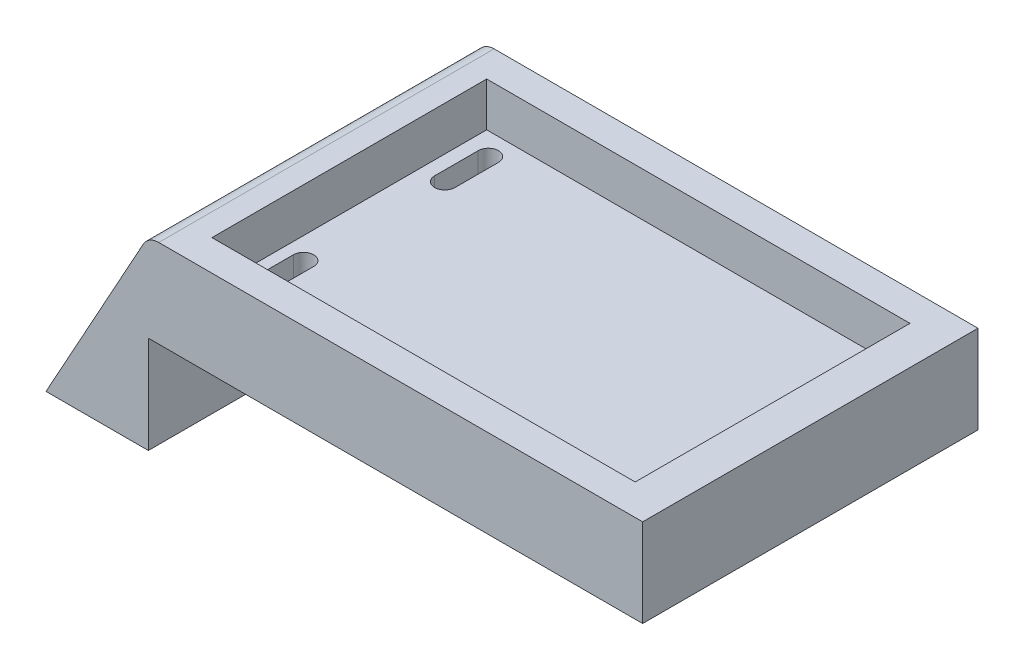
ISO-10303-21;
HEADER;
FILE_DESCRIPTION(('STEP AP214'),'2;1');
FILE_NAME('part.step','',(''),(''),'','','');
FILE_SCHEMA(('AUTOMOTIVE_DESIGN { 1 0 10303 214 1 1 1 1 }'));
ENDSEC;
DATA;
#1=APPLICATION_CONTEXT('core data for automotive mechanical design processes');
#2=APPLICATION_PROTOCOL_DEFINITION('international standard','automotive_design',2000,#1);
#3=PRODUCT_CONTEXT('',#1,'mechanical');
#4=PRODUCT('Part','Part','',(#3));
#5=PRODUCT_RELATED_PRODUCT_CATEGORY('part','',(#4));
#6=PRODUCT_DEFINITION_FORMATION('','',#4);
#7=PRODUCT_DEFINITION_CONTEXT('part definition',#1,'design');
#8=PRODUCT_DEFINITION('design','',#6,#7);
#9=PRODUCT_DEFINITION_SHAPE('','',#8);
#10=(LENGTH_UNIT() NAMED_UNIT(*) SI_UNIT(.MILLI.,.METRE.));
#11=(NAMED_UNIT(*) PLANE_ANGLE_UNIT() SI_UNIT($,.RADIAN.));
#12=(NAMED_UNIT(*) SI_UNIT($,.STERADIAN.) SOLID_ANGLE_UNIT());
#13=UNCERTAINTY_MEASURE_WITH_UNIT(LENGTH_MEASURE(1.E-05),#10,'distance_accuracy_value','');
#14=(GEOMETRIC_REPRESENTATION_CONTEXT(3) GLOBAL_UNCERTAINTY_ASSIGNED_CONTEXT((#13)) GLOBAL_UNIT_ASSIGNED_CONTEXT((#10,
#11,#12)) REPRESENTATION_CONTEXT('',''));
#15=CARTESIAN_POINT('',(0.,0.,0.));
#16=DIRECTION('',(0.,0.,1.));
#17=DIRECTION('',(1.,0.,0.));
#18=AXIS2_PLACEMENT_3D('',#15,#16,#17);
#19=CARTESIAN_POINT('',(-34.7548784400583,-12.7,-21.5329138161231));
#20=DIRECTION('',(0.,0.,-1.));
#21=DIRECTION('',(-1.,0.,0.));
#22=AXIS2_PLACEMENT_3D('',#19,#20,#21);
#23=PLANE('',#22);
#24=CARTESIAN_POINT('',(13.9227090818307,-12.7,-21.5329138161231));
#25=DIRECTION('',(0.,0.,-1.));
#26=DIRECTION('',(-1.,0.,0.));
#27=AXIS2_PLACEMENT_3D('',#24,#25,#26);
#28=CIRCLE('',#27,7.62);
#29=CARTESIAN_POINT('',(6.30270908183067,-12.7,-21.5329138161231));
#30=VERTEX_POINT('',#29);
#31=CARTESIAN_POINT('',(21.5427090818307,-12.7,-21.5329138161231));
#32=VERTEX_POINT('',#31);
#33=EDGE_CURVE('E261',#30,#32,#28,.T.);
#34=ORIENTED_EDGE('',*,*,#33,.F.);
#35=DIRECTION('',(-1.,0.,0.));
#36=VECTOR('',#35,1.);
#37=CARTESIAN_POINT('',(-34.7548784400583,-12.7,-21.5329138161231));
#38=LINE('',#37,#36);
#39=CARTESIAN_POINT('',(-34.7548784400583,-12.7,-21.5329138161231));
#40=VERTEX_POINT('',#39);
#41=EDGE_CURVE('E331',#30,#40,#38,.T.);
#42=ORIENTED_EDGE('',*,*,#41,.T.);
#43=DIRECTION('',(0.,1.,0.));
#44=VECTOR('',#43,1.);
#45=CARTESIAN_POINT('',(-34.7548784400583,-12.7,-21.5329138161231));
#46=LINE('',#45,#44);
#47=CARTESIAN_POINT('',(-34.7548784400583,-26.7296636371694,-21.5329138161231));
#48=VERTEX_POINT('',#47);
#49=EDGE_CURVE('E275',#48,#40,#46,.T.);
#50=ORIENTED_EDGE('',*,*,#49,.F.);
#51=DIRECTION('',(1.,0.,0.));
#52=VECTOR('',#51,1.);
#53=CARTESIAN_POINT('',(-34.7548784400583,-26.7296636371694,-21.5329138161231));
#54=LINE('',#53,#52);
#55=CARTESIAN_POINT('',(-49.5144814985387,-26.7296636371694,-21.5329138161231));
#56=VERTEX_POINT('',#55);
#57=EDGE_CURVE('E376',#56,#48,#54,.T.);
#58=ORIENTED_EDGE('',*,*,#57,.F.);
#59=DIRECTION('',(-0.483383688140556,-0.875408596050801,0.));
#60=VECTOR('',#59,1.);
#61=CARTESIAN_POINT('',(-49.5144814985387,-26.7296636371694,-21.5329138161231));
#62=LINE('',#61,#60);
#63=CARTESIAN_POINT('',(-35.4794528893374,-1.31220543212299,-21.5329138161231));
#64=VERTEX_POINT('',#63);
#65=EDGE_CURVE('E380',#64,#56,#62,.T.);
#66=ORIENTED_EDGE('',*,*,#65,.F.);
#67=CARTESIAN_POINT('',(-33.2559150553684,-2.54,-21.5329138161231));
#68=DIRECTION('',(0.,0.,-1.));
#69=DIRECTION('',(-1.,0.,0.));
#70=AXIS2_PLACEMENT_3D('',#67,#68,#69);
#71=CIRCLE('',#70,2.54);
#72=CARTESIAN_POINT('',(-33.2559150553684,0.,-21.5329138161231));
#73=VERTEX_POINT('',#72);
#74=EDGE_CURVE('E340',#64,#73,#71,.T.);
#75=ORIENTED_EDGE('',*,*,#74,.T.);
#76=DIRECTION('',(-1.,0.,0.));
#77=VECTOR('',#76,1.);
#78=CARTESIAN_POINT('',(-34.7548784400583,0.,-21.5329138161231));
#79=LINE('',#78,#77);
#80=CARTESIAN_POINT('',(36.5178070565831,0.,-21.5329138161231));
#81=VERTEX_POINT('',#80);
#82=EDGE_CURVE('E321',#81,#73,#79,.T.);
#83=ORIENTED_EDGE('',*,*,#82,.F.);
#84=DIRECTION('',(0.,1.,0.));
#85=VECTOR('',#84,1.);
#86=CARTESIAN_POINT('',(36.5178070565831,-12.7,-21.5329138161231));
#87=LINE('',#86,#85);
#88=CARTESIAN_POINT('',(36.5178070565831,-12.7,-21.5329138161231));
#89=VERTEX_POINT('',#88);
#90=EDGE_CURVE('E357',#89,#81,#87,.T.);
#91=ORIENTED_EDGE('',*,*,#90,.F.);
#92=EDGE_CURVE('E328',#89,#32,#38,.T.);
#93=ORIENTED_EDGE('',*,*,#92,.T.);
#94=EDGE_LOOP('',(#34,#42,#50,#58,#66,#75,#83,#91,#93));
#95=FACE_BOUND('',#94,.T.);
#96=ADVANCED_FACE('F32',(#95),#23,.T.);
#97=CARTESIAN_POINT('',(36.5178070565831,-12.7,-21.5329138161231));
#98=DIRECTION('',(1.,0.,0.));
#99=DIRECTION('',(0.,0.,-1.));
#100=AXIS2_PLACEMENT_3D('',#97,#98,#99);
#101=PLANE('',#100);
#102=DIRECTION('',(0.,0.,-1.));
#103=VECTOR('',#102,1.);
#104=CARTESIAN_POINT('',(36.5178070565831,0.,-21.5329138161231));
#105=LINE('',#104,#103);
#106=CARTESIAN_POINT('',(36.5178070565831,0.,26.8216996656972));
#107=VERTEX_POINT('',#106);
#108=EDGE_CURVE('E400',#107,#81,#105,.T.);
#109=ORIENTED_EDGE('',*,*,#108,.F.);
#110=DIRECTION('',(0.,1.,0.));
#111=VECTOR('',#110,1.);
#112=CARTESIAN_POINT('',(36.5178070565831,-12.7,26.8216996656972));
#113=LINE('',#112,#111);
#114=CARTESIAN_POINT('',(36.5178070565831,-12.7,26.8216996656972));
#115=VERTEX_POINT('',#114);
#116=EDGE_CURVE('E322',#115,#107,#113,.T.);
#117=ORIENTED_EDGE('',*,*,#116,.F.);
#118=DIRECTION('',(0.,0.,-1.));
#119=VECTOR('',#118,1.);
#120=CARTESIAN_POINT('',(36.5178070565831,-12.7,-21.5329138161231));
#121=LINE('',#120,#119);
#122=EDGE_CURVE('E313',#115,#89,#121,.T.);
#123=ORIENTED_EDGE('',*,*,#122,.T.);
#124=ORIENTED_EDGE('',*,*,#90,.T.);
#125=EDGE_LOOP('',(#109,#117,#123,#124));
#126=FACE_BOUND('',#125,.T.);
#127=ADVANCED_FACE('F413',(#126),#101,.T.);
#128=CARTESIAN_POINT('',(-34.7548784400583,-12.7,26.8216996656972));
#129=DIRECTION('',(0.,0.,1.));
#130=DIRECTION('',(1.,0.,0.));
#131=AXIS2_PLACEMENT_3D('',#128,#129,#130);
#132=PLANE('',#131);
#133=DIRECTION('',(1.,0.,0.));
#134=VECTOR('',#133,1.);
#135=CARTESIAN_POINT('',(-34.7548784400583,0.,26.8216996656972));
#136=LINE('',#135,#134);
#137=CARTESIAN_POINT('',(-33.2559150553684,0.,26.8216996656972));
#138=VERTEX_POINT('',#137);
#139=EDGE_CURVE('E304',#138,#107,#136,.T.);
#140=ORIENTED_EDGE('',*,*,#139,.F.);
#141=CARTESIAN_POINT('',(-33.2559150553684,-2.54,26.8216996656972));
#142=DIRECTION('',(0.,0.,1.));
#143=DIRECTION('',(1.,0.,0.));
#144=AXIS2_PLACEMENT_3D('',#141,#142,#143);
#145=CIRCLE('',#144,2.54);
#146=CARTESIAN_POINT('',(-35.4794528893374,-1.31220543212299,26.8216996656972));
#147=VERTEX_POINT('',#146);
#148=EDGE_CURVE('E387',#138,#147,#145,.T.);
#149=ORIENTED_EDGE('',*,*,#148,.T.);
#150=DIRECTION('',(-0.483383688140556,-0.875408596050801,0.));
#151=VECTOR('',#150,1.);
#152=CARTESIAN_POINT('',(-49.5144814985387,-26.7296636371694,26.8216996656972));
#153=LINE('',#152,#151);
#154=CARTESIAN_POINT('',(-49.5144814985387,-26.7296636371694,26.8216996656972));
#155=VERTEX_POINT('',#154);
#156=EDGE_CURVE('E274',#147,#155,#153,.T.);
#157=ORIENTED_EDGE('',*,*,#156,.T.);
#158=DIRECTION('',(1.,0.,0.));
#159=VECTOR('',#158,1.);
#160=CARTESIAN_POINT('',(-34.7548784400583,-26.7296636371694,26.8216996656972));
#161=LINE('',#160,#159);
#162=CARTESIAN_POINT('',(-34.7548784400583,-26.7296636371694,26.8216996656972));
#163=VERTEX_POINT('',#162);
#164=EDGE_CURVE('E268',#155,#163,#161,.T.);
#165=ORIENTED_EDGE('',*,*,#164,.T.);
#166=DIRECTION('',(0.,1.,0.));
#167=VECTOR('',#166,1.);
#168=CARTESIAN_POINT('',(-34.7548784400583,-12.7,26.8216996656972));
#169=LINE('',#168,#167);
#170=CARTESIAN_POINT('',(-34.7548784400583,-12.7,26.8216996656972));
#171=VERTEX_POINT('',#170);
#172=EDGE_CURVE('E264',#163,#171,#169,.T.);
#173=ORIENTED_EDGE('',*,*,#172,.T.);
#174=DIRECTION('',(1.,0.,0.));
#175=VECTOR('',#174,1.);
#176=CARTESIAN_POINT('',(-34.7548784400583,-12.7,26.8216996656972));
#177=LINE('',#176,#175);
#178=EDGE_CURVE('E320',#171,#115,#177,.T.);
#179=ORIENTED_EDGE('',*,*,#178,.T.);
#180=ORIENTED_EDGE('',*,*,#116,.T.);
#181=EDGE_LOOP('',(#140,#149,#157,#165,#173,#179,#180));
#182=FACE_BOUND('',#181,.T.);
#183=ADVANCED_FACE('F364',(#182),#132,.T.);
#184=CARTESIAN_POINT('',(0.,-12.7,0.));
#185=DIRECTION('',(0.,1.,0.));
#186=DIRECTION('',(0.,0.,1.));
#187=AXIS2_PLACEMENT_3D('',#184,#185,#186);
#188=PLANE('',#187);
#189=DIRECTION('',(0.,0.,1.));
#190=VECTOR('',#189,1.);
#191=CARTESIAN_POINT('',(-25.4358431669078,-12.7,12.2982140969415));
#192=LINE('',#191,#190);
#193=CARTESIAN_POINT('',(-25.4358431669078,-12.7,12.2982140969415));
#194=VERTEX_POINT('',#193);
#195=CARTESIAN_POINT('',(-25.4358431669078,-12.7,18.5882371670049));
#196=VERTEX_POINT('',#195);
#197=EDGE_CURVE('E209',#194,#196,#192,.T.);
#198=ORIENTED_EDGE('',*,*,#197,.F.);
#199=CARTESIAN_POINT('',(-26.9006430599363,-12.7,12.2982140969415));
#200=DIRECTION('',(0.,1.,0.));
#201=DIRECTION('',(0.,0.,1.));
#202=AXIS2_PLACEMENT_3D('',#199,#200,#201);
#203=CIRCLE('',#202,1.46479989302845);
#204=CARTESIAN_POINT('',(-28.3654429529647,-12.7,12.2982140969415));
#205=VERTEX_POINT('',#204);
#206=EDGE_CURVE('E212',#205,#194,#203,.F.);
#207=ORIENTED_EDGE('',*,*,#206,.F.);
#208=DIRECTION('',(0.,0.,-1.));
#209=VECTOR('',#208,1.);
#210=CARTESIAN_POINT('',(-28.3654429529647,-12.7,12.2982140969415));
#211=LINE('',#210,#209);
#212=CARTESIAN_POINT('',(-28.3654429529647,-12.7,18.5882371670049));
#213=VERTEX_POINT('',#212);
#214=EDGE_CURVE('E214',#213,#205,#211,.T.);
#215=ORIENTED_EDGE('',*,*,#214,.F.);
#216=CARTESIAN_POINT('',(-26.9006430599363,-12.7,18.5882371670049));
#217=DIRECTION('',(0.,1.,0.));
#218=DIRECTION('',(0.,0.,1.));
#219=AXIS2_PLACEMENT_3D('',#216,#217,#218);
#220=CIRCLE('',#219,1.46479989302845);
#221=EDGE_CURVE('E207',#196,#213,#220,.F.);
#222=ORIENTED_EDGE('',*,*,#221,.F.);
#223=EDGE_LOOP('',(#198,#207,#215,#222));
#224=FACE_BOUND('',#223,.T.);
#225=DIRECTION('',(0.,0.,1.));
#226=VECTOR('',#225,1.);
#227=CARTESIAN_POINT('',(-25.1098998323982,-12.7,-14.0284764458604));
#228=LINE('',#227,#226);
#229=CARTESIAN_POINT('',(-25.1098998323982,-12.7,-14.0284764458604));
#230=VERTEX_POINT('',#229);
#231=CARTESIAN_POINT('',(-25.1098998323982,-12.7,-7.73845337579703));
#232=VERTEX_POINT('',#231);
#233=EDGE_CURVE('E236',#230,#232,#228,.T.);
#234=ORIENTED_EDGE('',*,*,#233,.F.);
#235=CARTESIAN_POINT('',(-26.5746997254267,-12.7,-14.0284764458604));
#236=DIRECTION('',(0.,1.,0.));
#237=DIRECTION('',(0.,0.,1.));
#238=AXIS2_PLACEMENT_3D('',#235,#236,#237);
#239=CIRCLE('',#238,1.46479989302845);
#240=CARTESIAN_POINT('',(-28.0394996184551,-12.7,-14.0284764458604));
#241=VERTEX_POINT('',#240);
#242=EDGE_CURVE('E239',#241,#230,#239,.F.);
#243=ORIENTED_EDGE('',*,*,#242,.F.);
#244=DIRECTION('',(0.,0.,-1.));
#245=VECTOR('',#244,1.);
#246=CARTESIAN_POINT('',(-28.0394996184551,-12.7,-14.0284764458604));
#247=LINE('',#246,#245);
#248=CARTESIAN_POINT('',(-28.0394996184551,-12.7,-7.73845337579703));
#249=VERTEX_POINT('',#248);
#250=EDGE_CURVE('E241',#249,#241,#247,.T.);
#251=ORIENTED_EDGE('',*,*,#250,.F.);
#252=CARTESIAN_POINT('',(-26.5746997254267,-12.7,-7.73845337579703));
#253=DIRECTION('',(0.,1.,0.));
#254=DIRECTION('',(0.,0.,1.));
#255=AXIS2_PLACEMENT_3D('',#252,#253,#254);
#256=CIRCLE('',#255,1.46479989302845);
#257=EDGE_CURVE('E233',#232,#249,#256,.F.);
#258=ORIENTED_EDGE('',*,*,#257,.F.);
#259=EDGE_LOOP('',(#234,#243,#251,#258));
#260=FACE_BOUND('',#259,.T.);
#261=DIRECTION('',(-1.,0.,0.));
#262=VECTOR('',#261,1.);
#263=CARTESIAN_POINT('',(0.,-12.7,-18.9929138161231));
#264=LINE('',#263,#262);
#265=CARTESIAN_POINT('',(21.5427090818307,-12.7,-18.9929138161231));
#266=VERTEX_POINT('',#265);
#267=CARTESIAN_POINT('',(6.30270908183067,-12.7,-18.9929138161231));
#268=VERTEX_POINT('',#267);
#269=EDGE_CURVE('E342',#266,#268,#264,.T.);
#270=ORIENTED_EDGE('',*,*,#269,.F.);
#271=DIRECTION('',(0.,0.,-1.));
#272=VECTOR('',#271,1.);
#273=CARTESIAN_POINT('',(21.5427090818307,-12.7,-18.9929138161231));
#274=LINE('',#273,#272);
#275=EDGE_CURVE('E11',#266,#32,#274,.T.);
#276=ORIENTED_EDGE('',*,*,#275,.T.);
#277=ORIENTED_EDGE('',*,*,#92,.F.);
#278=ORIENTED_EDGE('',*,*,#122,.F.);
#279=ORIENTED_EDGE('',*,*,#178,.F.);
#280=DIRECTION('',(0.,0.,1.));
#281=VECTOR('',#280,1.);
#282=CARTESIAN_POINT('',(-34.7548784400583,-12.7,-21.5329138161231));
#283=LINE('',#282,#281);
#284=EDGE_CURVE('E316',#40,#171,#283,.T.);
#285=ORIENTED_EDGE('',*,*,#284,.F.);
#286=ORIENTED_EDGE('',*,*,#41,.F.);
#287=DIRECTION('',(0.,0.,-1.));
#288=VECTOR('',#287,1.);
#289=CARTESIAN_POINT('',(6.30270908183067,-12.7,-18.9929138161231));
#290=LINE('',#289,#288);
#291=EDGE_CURVE('E40',#30,#268,#290,.F.);
#292=ORIENTED_EDGE('',*,*,#291,.T.);
#293=EDGE_LOOP('',(#270,#276,#277,#278,#279,#285,#286,#292));
#294=FACE_BOUND('',#293,.T.);
#295=ADVANCED_FACE('F347',(#224,#260,#294),#188,.F.);
#296=CARTESIAN_POINT('',(0.,0.,0.));
#297=DIRECTION('',(0.,1.,0.));
#298=DIRECTION('',(0.,0.,1.));
#299=AXIS2_PLACEMENT_3D('',#296,#297,#298);
#300=PLANE('',#299);
#301=DIRECTION('',(0.,0.,1.));
#302=VECTOR('',#301,1.);
#303=CARTESIAN_POINT('',(-30.0270973551157,0.,-17.2355941958845));
#304=LINE('',#303,#302);
#305=CARTESIAN_POINT('',(-30.0270973551157,0.,-17.2355941958845));
#306=VERTEX_POINT('',#305);
#307=CARTESIAN_POINT('',(-30.0270973551157,0.,22.3816153264591));
#308=VERTEX_POINT('',#307);
#309=EDGE_CURVE('E292',#306,#308,#304,.T.);
#310=ORIENTED_EDGE('',*,*,#309,.F.);
#311=DIRECTION('',(-1.,0.,0.));
#312=VECTOR('',#311,1.);
#313=CARTESIAN_POINT('',(-30.0270973551157,0.,-17.2355941958845));
#314=LINE('',#313,#312);
#315=CARTESIAN_POINT('',(31.0048200171435,0.,-17.2355941958845));
#316=VERTEX_POINT('',#315);
#317=EDGE_CURVE('E282',#316,#306,#314,.T.);
#318=ORIENTED_EDGE('',*,*,#317,.F.);
#319=DIRECTION('',(0.,0.,-1.));
#320=VECTOR('',#319,1.);
#321=CARTESIAN_POINT('',(31.0048200171435,0.,-17.2355941958845));
#322=LINE('',#321,#320);
#323=CARTESIAN_POINT('',(31.0048200171435,0.,22.3816153264591));
#324=VERTEX_POINT('',#323);
#325=EDGE_CURVE('E297',#324,#316,#322,.T.);
#326=ORIENTED_EDGE('',*,*,#325,.F.);
#327=DIRECTION('',(1.,0.,0.));
#328=VECTOR('',#327,1.);
#329=CARTESIAN_POINT('',(-30.0270973551157,0.,22.3816153264591));
#330=LINE('',#329,#328);
#331=EDGE_CURVE('E294',#308,#324,#330,.T.);
#332=ORIENTED_EDGE('',*,*,#331,.F.);
#333=EDGE_LOOP('',(#310,#318,#326,#332));
#334=FACE_BOUND('',#333,.T.);
#335=ORIENTED_EDGE('',*,*,#82,.T.);
#336=DIRECTION('',(0.,0.,1.));
#337=VECTOR('',#336,1.);
#338=CARTESIAN_POINT('',(-33.2559150553684,0.,0.));
#339=LINE('',#338,#337);
#340=EDGE_CURVE('E334',#73,#138,#339,.T.);
#341=ORIENTED_EDGE('',*,*,#340,.T.);
#342=ORIENTED_EDGE('',*,*,#139,.T.);
#343=ORIENTED_EDGE('',*,*,#108,.T.);
#344=EDGE_LOOP('',(#335,#341,#342,#343));
#345=FACE_BOUND('',#344,.T.);
#346=ADVANCED_FACE('F401',(#334,#345),#300,.T.);
#347=CARTESIAN_POINT('',(-30.0270973551157,-6.35,-17.2355941958845));
#348=DIRECTION('',(-1.,0.,0.));
#349=DIRECTION('',(0.,0.,1.));
#350=AXIS2_PLACEMENT_3D('',#347,#348,#349);
#351=PLANE('',#350);
#352=ORIENTED_EDGE('',*,*,#309,.T.);
#353=DIRECTION('',(0.,1.,0.));
#354=VECTOR('',#353,1.);
#355=CARTESIAN_POINT('',(-30.0270973551157,-6.35,22.3816153264591));
#356=LINE('',#355,#354);
#357=CARTESIAN_POINT('',(-30.0270973551157,-6.35,22.3816153264591));
#358=VERTEX_POINT('',#357);
#359=EDGE_CURVE('E291',#358,#308,#356,.T.);
#360=ORIENTED_EDGE('',*,*,#359,.F.);
#361=DIRECTION('',(0.,0.,1.));
#362=VECTOR('',#361,1.);
#363=CARTESIAN_POINT('',(-30.0270973551157,-6.35,-17.2355941958845));
#364=LINE('',#363,#362);
#365=CARTESIAN_POINT('',(-30.0270973551157,-6.35,-17.2355941958845));
#366=VERTEX_POINT('',#365);
#367=EDGE_CURVE('E278',#366,#358,#364,.T.);
#368=ORIENTED_EDGE('',*,*,#367,.F.);
#369=DIRECTION('',(0.,1.,0.));
#370=VECTOR('',#369,1.);
#371=CARTESIAN_POINT('',(-30.0270973551157,-6.35,-17.2355941958845));
#372=LINE('',#371,#370);
#373=EDGE_CURVE('E302',#366,#306,#372,.T.);
#374=ORIENTED_EDGE('',*,*,#373,.T.);
#375=EDGE_LOOP('',(#352,#360,#368,#374));
#376=FACE_BOUND('',#375,.T.);
#377=ADVANCED_FACE('F429',(#376),#351,.F.);
#378=CARTESIAN_POINT('',(-30.0270973551157,-6.35,-17.2355941958845));
#379=DIRECTION('',(0.,0.,-1.));
#380=DIRECTION('',(-1.,0.,0.));
#381=AXIS2_PLACEMENT_3D('',#378,#379,#380);
#382=PLANE('',#381);
#383=ORIENTED_EDGE('',*,*,#317,.T.);
#384=ORIENTED_EDGE('',*,*,#373,.F.);
#385=DIRECTION('',(-1.,0.,0.));
#386=VECTOR('',#385,1.);
#387=CARTESIAN_POINT('',(-30.0270973551157,-6.35,-17.2355941958845));
#388=LINE('',#387,#386);
#389=CARTESIAN_POINT('',(31.0048200171435,-6.35,-17.2355941958845));
#390=VERTEX_POINT('',#389);
#391=EDGE_CURVE('E288',#390,#366,#388,.T.);
#392=ORIENTED_EDGE('',*,*,#391,.F.);
#393=DIRECTION('',(0.,1.,0.));
#394=VECTOR('',#393,1.);
#395=CARTESIAN_POINT('',(31.0048200171435,-6.35,-17.2355941958845));
#396=LINE('',#395,#394);
#397=EDGE_CURVE('E305',#390,#316,#396,.T.);
#398=ORIENTED_EDGE('',*,*,#397,.T.);
#399=EDGE_LOOP('',(#383,#384,#392,#398));
#400=FACE_BOUND('',#399,.T.);
#401=ADVANCED_FACE('F436',(#400),#382,.F.);
#402=CARTESIAN_POINT('',(31.0048200171435,-6.35,-17.2355941958845));
#403=DIRECTION('',(1.,0.,0.));
#404=DIRECTION('',(0.,0.,-1.));
#405=AXIS2_PLACEMENT_3D('',#402,#403,#404);
#406=PLANE('',#405);
#407=ORIENTED_EDGE('',*,*,#325,.T.);
#408=ORIENTED_EDGE('',*,*,#397,.F.);
#409=DIRECTION('',(0.,0.,-1.));
#410=VECTOR('',#409,1.);
#411=CARTESIAN_POINT('',(31.0048200171435,-6.35,-17.2355941958845));
#412=LINE('',#411,#410);
#413=CARTESIAN_POINT('',(31.0048200171435,-6.35,22.3816153264591));
#414=VERTEX_POINT('',#413);
#415=EDGE_CURVE('E285',#414,#390,#412,.T.);
#416=ORIENTED_EDGE('',*,*,#415,.F.);
#417=DIRECTION('',(0.,1.,0.));
#418=VECTOR('',#417,1.);
#419=CARTESIAN_POINT('',(31.0048200171435,-6.35,22.3816153264591));
#420=LINE('',#419,#418);
#421=EDGE_CURVE('E307',#414,#324,#420,.T.);
#422=ORIENTED_EDGE('',*,*,#421,.T.);
#423=EDGE_LOOP('',(#407,#408,#416,#422));
#424=FACE_BOUND('',#423,.T.);
#425=ADVANCED_FACE('F441',(#424),#406,.F.);
#426=CARTESIAN_POINT('',(-30.0270973551157,-6.35,22.3816153264591));
#427=DIRECTION('',(0.,0.,1.));
#428=DIRECTION('',(1.,0.,0.));
#429=AXIS2_PLACEMENT_3D('',#426,#427,#428);
#430=PLANE('',#429);
#431=ORIENTED_EDGE('',*,*,#331,.T.);
#432=ORIENTED_EDGE('',*,*,#421,.F.);
#433=DIRECTION('',(1.,0.,0.));
#434=VECTOR('',#433,1.);
#435=CARTESIAN_POINT('',(-30.0270973551157,-6.35,22.3816153264591));
#436=LINE('',#435,#434);
#437=EDGE_CURVE('E281',#358,#414,#436,.T.);
#438=ORIENTED_EDGE('',*,*,#437,.F.);
#439=ORIENTED_EDGE('',*,*,#359,.T.);
#440=EDGE_LOOP('',(#431,#432,#438,#439));
#441=FACE_BOUND('',#440,.T.);
#442=ADVANCED_FACE('F438',(#441),#430,.F.);
#443=CARTESIAN_POINT('',(0.,-6.35,0.));
#444=DIRECTION('',(0.,1.,0.));
#445=DIRECTION('',(0.,0.,1.));
#446=AXIS2_PLACEMENT_3D('',#443,#444,#445);
#447=PLANE('',#446);
#448=CARTESIAN_POINT('',(-26.9006430599363,-6.35,12.2982140969415));
#449=DIRECTION('',(0.,1.,0.));
#450=DIRECTION('',(0.,0.,1.));
#451=AXIS2_PLACEMENT_3D('',#448,#449,#450);
#452=CIRCLE('',#451,1.46479989302845);
#453=CARTESIAN_POINT('',(-25.4358431669078,-6.35,12.2982140969415));
#454=VERTEX_POINT('',#453);
#455=CARTESIAN_POINT('',(-28.3654429529647,-6.35,12.2982140969415));
#456=VERTEX_POINT('',#455);
#457=EDGE_CURVE('E192',#454,#456,#452,.T.);
#458=ORIENTED_EDGE('',*,*,#457,.F.);
#459=DIRECTION('',(0.,0.,-1.));
#460=VECTOR('',#459,1.);
#461=CARTESIAN_POINT('',(-25.4358431669078,-6.35,12.2982140969415));
#462=LINE('',#461,#460);
#463=CARTESIAN_POINT('',(-25.4358431669078,-6.35,18.5882371670049));
#464=VERTEX_POINT('',#463);
#465=EDGE_CURVE('E221',#464,#454,#462,.T.);
#466=ORIENTED_EDGE('',*,*,#465,.F.);
#467=CARTESIAN_POINT('',(-26.9006430599363,-6.35,18.5882371670049));
#468=DIRECTION('',(0.,1.,0.));
#469=DIRECTION('',(0.,0.,1.));
#470=AXIS2_PLACEMENT_3D('',#467,#468,#469);
#471=CIRCLE('',#470,1.46479989302845);
#472=CARTESIAN_POINT('',(-28.3654429529647,-6.35,18.5882371670049));
#473=VERTEX_POINT('',#472);
#474=EDGE_CURVE('E218',#473,#464,#471,.T.);
#475=ORIENTED_EDGE('',*,*,#474,.F.);
#476=DIRECTION('',(0.,0.,1.));
#477=VECTOR('',#476,1.);
#478=CARTESIAN_POINT('',(-28.3654429529647,-6.35,12.2982140969415));
#479=LINE('',#478,#477);
#480=EDGE_CURVE('E216',#456,#473,#479,.T.);
#481=ORIENTED_EDGE('',*,*,#480,.F.);
#482=EDGE_LOOP('',(#458,#466,#475,#481));
#483=FACE_BOUND('',#482,.T.);
#484=CARTESIAN_POINT('',(-26.5746997254267,-6.35,-14.0284764458604));
#485=DIRECTION('',(0.,1.,0.));
#486=DIRECTION('',(0.,0.,1.));
#487=AXIS2_PLACEMENT_3D('',#484,#485,#486);
#488=CIRCLE('',#487,1.46479989302845);
#489=CARTESIAN_POINT('',(-25.1098998323982,-6.35,-14.0284764458604));
#490=VERTEX_POINT('',#489);
#491=CARTESIAN_POINT('',(-28.0394996184551,-6.35,-14.0284764458604));
#492=VERTEX_POINT('',#491);
#493=EDGE_CURVE('E232',#490,#492,#488,.T.);
#494=ORIENTED_EDGE('',*,*,#493,.F.);
#495=DIRECTION('',(0.,0.,-1.));
#496=VECTOR('',#495,1.);
#497=CARTESIAN_POINT('',(-25.1098998323982,-6.35,-14.0284764458604));
#498=LINE('',#497,#496);
#499=CARTESIAN_POINT('',(-25.1098998323982,-6.35,-7.73845337579703));
#500=VERTEX_POINT('',#499);
#501=EDGE_CURVE('E249',#500,#490,#498,.T.);
#502=ORIENTED_EDGE('',*,*,#501,.F.);
#503=CARTESIAN_POINT('',(-26.5746997254267,-6.35,-7.73845337579703));
#504=DIRECTION('',(0.,1.,0.));
#505=DIRECTION('',(0.,0.,1.));
#506=AXIS2_PLACEMENT_3D('',#503,#504,#505);
#507=CIRCLE('',#506,1.46479989302845);
#508=CARTESIAN_POINT('',(-28.0394996184551,-6.35,-7.73845337579703));
#509=VERTEX_POINT('',#508);
#510=EDGE_CURVE('E246',#509,#500,#507,.T.);
#511=ORIENTED_EDGE('',*,*,#510,.F.);
#512=DIRECTION('',(0.,0.,1.));
#513=VECTOR('',#512,1.);
#514=CARTESIAN_POINT('',(-28.0394996184551,-6.35,-14.0284764458604));
#515=LINE('',#514,#513);
#516=EDGE_CURVE('E243',#492,#509,#515,.T.);
#517=ORIENTED_EDGE('',*,*,#516,.F.);
#518=EDGE_LOOP('',(#494,#502,#511,#517));
#519=FACE_BOUND('',#518,.T.);
#520=ORIENTED_EDGE('',*,*,#367,.T.);
#521=ORIENTED_EDGE('',*,*,#437,.T.);
#522=ORIENTED_EDGE('',*,*,#415,.T.);
#523=ORIENTED_EDGE('',*,*,#391,.T.);
#524=EDGE_LOOP('',(#520,#521,#522,#523));
#525=FACE_BOUND('',#524,.T.);
#526=ADVANCED_FACE('F410',(#483,#519,#525),#447,.T.);
#527=CARTESIAN_POINT('',(-49.5144814985387,-26.7296636371694,-52.0668424955466));
#528=DIRECTION('',(-0.875408596050801,0.483383688140556,0.));
#529=DIRECTION('',(-0.483383688140556,-0.875408596050801,0.));
#530=AXIS2_PLACEMENT_3D('',#527,#528,#529);
#531=PLANE('',#530);
#532=ORIENTED_EDGE('',*,*,#156,.F.);
#533=DIRECTION('',(0.,0.,1.));
#534=VECTOR('',#533,1.);
#535=CARTESIAN_POINT('',(-35.4794528893374,-1.31220543212299,-52.0668424955466));
#536=LINE('',#535,#534);
#537=EDGE_CURVE('E390',#147,#64,#536,.F.);
#538=ORIENTED_EDGE('',*,*,#537,.T.);
#539=ORIENTED_EDGE('',*,*,#65,.T.);
#540=DIRECTION('',(0.,0.,1.));
#541=VECTOR('',#540,1.);
#542=CARTESIAN_POINT('',(-49.5144814985387,-26.7296636371694,-52.0668424955466));
#543=LINE('',#542,#541);
#544=EDGE_CURVE('E378',#56,#155,#543,.T.);
#545=ORIENTED_EDGE('',*,*,#544,.T.);
#546=EDGE_LOOP('',(#532,#538,#539,#545));
#547=FACE_BOUND('',#546,.T.);
#548=ADVANCED_FACE('F389',(#547),#531,.T.);
#549=CARTESIAN_POINT('',(-34.7548784400583,-26.7296636371694,-52.0668424955466));
#550=DIRECTION('',(0.,-1.,0.));
#551=DIRECTION('',(0.,0.,-1.));
#552=AXIS2_PLACEMENT_3D('',#549,#550,#551);
#553=PLANE('',#552);
#554=CARTESIAN_POINT('',(-34.7548784400583,-26.7296636371694,2.64439292478705));
#555=DIRECTION('',(0.,-1.,0.));
#556=DIRECTION('',(0.,0.,-1.));
#557=AXIS2_PLACEMENT_3D('',#554,#555,#556);
#558=CIRCLE('',#557,6.1837307243377);
#559=CARTESIAN_POINT('',(-34.7548784400583,-26.7296636371694,8.82812364912475));
#560=VERTEX_POINT('',#559);
#561=CARTESIAN_POINT('',(-34.7548784400583,-26.7296636371694,-3.53933779955064));
#562=VERTEX_POINT('',#561);
#563=EDGE_CURVE('E47',#560,#562,#558,.T.);
#564=ORIENTED_EDGE('',*,*,#563,.F.);
#565=DIRECTION('',(0.,0.,1.));
#566=VECTOR('',#565,1.);
#567=CARTESIAN_POINT('',(-34.7548784400583,-26.7296636371694,-52.0668424955466));
#568=LINE('',#567,#566);
#569=EDGE_CURVE('E369',#560,#163,#568,.T.);
#570=ORIENTED_EDGE('',*,*,#569,.T.);
#571=ORIENTED_EDGE('',*,*,#164,.F.);
#572=ORIENTED_EDGE('',*,*,#544,.F.);
#573=ORIENTED_EDGE('',*,*,#57,.T.);
#574=EDGE_CURVE('E371',#48,#562,#568,.T.);
#575=ORIENTED_EDGE('',*,*,#574,.T.);
#576=EDGE_LOOP('',(#564,#570,#571,#572,#573,#575));
#577=FACE_BOUND('',#576,.T.);
#578=ADVANCED_FACE('F402',(#577),#553,.T.);
#579=CARTESIAN_POINT('',(-34.7548784400583,-12.7,-52.0668424955466));
#580=DIRECTION('',(1.,0.,0.));
#581=DIRECTION('',(0.,0.,-1.));
#582=AXIS2_PLACEMENT_3D('',#579,#580,#581);
#583=PLANE('',#582);
#584=DIRECTION('',(0.,0.959315799354055,-0.282335256582828));
#585=VECTOR('',#584,1.);
#586=CARTESIAN_POINT('',(-34.7548784400583,-13.5483287562623,4.94873839537312));
#587=LINE('',#586,#585);
#588=CARTESIAN_POINT('',(-34.7548784400583,-13.5483287562623,4.94873839537312));
#589=VERTEX_POINT('',#588);
#590=EDGE_CURVE('E199',#560,#589,#587,.T.);
#591=ORIENTED_EDGE('',*,*,#590,.T.);
#592=DIRECTION('',(0.,0.,-1.));
#593=VECTOR('',#592,1.);
#594=CARTESIAN_POINT('',(-34.7548784400583,-13.5483287562623,2.64439292478705));
#595=LINE('',#594,#593);
#596=CARTESIAN_POINT('',(-34.7548784400583,-13.5483287562623,0.340047454200985));
#597=VERTEX_POINT('',#596);
#598=EDGE_CURVE('E190',#589,#597,#595,.T.);
#599=ORIENTED_EDGE('',*,*,#598,.T.);
#600=DIRECTION('',(0.,0.959315799354055,0.282335256582828));
#601=VECTOR('',#600,1.);
#602=CARTESIAN_POINT('',(-34.7548784400583,-13.5483287562623,0.340047454200985));
#603=LINE('',#602,#601);
#604=EDGE_CURVE('E194',#562,#597,#603,.T.);
#605=ORIENTED_EDGE('',*,*,#604,.F.);
#606=ORIENTED_EDGE('',*,*,#574,.F.);
#607=ORIENTED_EDGE('',*,*,#49,.T.);
#608=ORIENTED_EDGE('',*,*,#284,.T.);
#609=ORIENTED_EDGE('',*,*,#172,.F.);
#610=ORIENTED_EDGE('',*,*,#569,.F.);
#611=EDGE_LOOP('',(#591,#599,#605,#606,#607,#608,#609,#610));
#612=FACE_BOUND('',#611,.T.);
#613=ADVANCED_FACE('F201',(#612),#583,.T.);
#614=CARTESIAN_POINT('',(-33.2559150553684,-2.54,0.));
#615=DIRECTION('',(0.,0.,1.));
#616=DIRECTION('',(1.,0.,0.));
#617=AXIS2_PLACEMENT_3D('',#614,#615,#616);
#618=CYLINDRICAL_SURFACE('',#617,2.54);
#619=ORIENTED_EDGE('',*,*,#74,.F.);
#620=ORIENTED_EDGE('',*,*,#537,.F.);
#621=ORIENTED_EDGE('',*,*,#148,.F.);
#622=ORIENTED_EDGE('',*,*,#340,.F.);
#623=EDGE_LOOP('',(#619,#620,#621,#622));
#624=FACE_BOUND('',#623,.T.);
#625=ADVANCED_FACE('F34',(#624),#618,.T.);
#626=CARTESIAN_POINT('',(13.9227090818307,-12.7,-18.9929138161231));
#627=DIRECTION('',(0.,0.,-1.));
#628=DIRECTION('',(-1.,0.,0.));
#629=AXIS2_PLACEMENT_3D('',#626,#627,#628);
#630=CYLINDRICAL_SURFACE('',#629,7.62);
#631=CARTESIAN_POINT('',(13.9227090818307,-12.7,-18.9929138161231));
#632=DIRECTION('',(0.,0.,-1.));
#633=DIRECTION('',(-1.,0.,0.));
#634=AXIS2_PLACEMENT_3D('',#631,#632,#633);
#635=CIRCLE('',#634,7.62);
#636=EDGE_CURVE('E262',#268,#266,#635,.T.);
#637=ORIENTED_EDGE('',*,*,#636,.F.);
#638=ORIENTED_EDGE('',*,*,#291,.F.);
#639=ORIENTED_EDGE('',*,*,#33,.T.);
#640=ORIENTED_EDGE('',*,*,#275,.F.);
#641=EDGE_LOOP('',(#637,#638,#639,#640));
#642=FACE_BOUND('',#641,.T.);
#643=ADVANCED_FACE('F352',(#642),#630,.F.);
#644=CARTESIAN_POINT('',(13.9227090818307,-12.7,-18.9929138161231));
#645=DIRECTION('',(0.,0.,-1.));
#646=DIRECTION('',(-1.,0.,0.));
#647=AXIS2_PLACEMENT_3D('',#644,#645,#646);
#648=PLANE('',#647);
#649=ORIENTED_EDGE('',*,*,#269,.T.);
#650=ORIENTED_EDGE('',*,*,#636,.T.);
#651=EDGE_LOOP('',(#649,#650));
#652=FACE_BOUND('',#651,.T.);
#653=ADVANCED_FACE('F498',(#652),#648,.T.);
#654=CARTESIAN_POINT('',(-26.5746997254267,-22.3738823910341,-14.0284764458604));
#655=DIRECTION('',(0.,1.,0.));
#656=DIRECTION('',(0.,0.,1.));
#657=AXIS2_PLACEMENT_3D('',#654,#655,#656);
#658=CYLINDRICAL_SURFACE('',#657,1.46479989302845);
#659=ORIENTED_EDGE('',*,*,#242,.T.);
#660=DIRECTION('',(0.,1.,0.));
#661=VECTOR('',#660,1.);
#662=CARTESIAN_POINT('',(-25.1098998323982,-22.3738823910341,-14.0284764458604));
#663=LINE('',#662,#661);
#664=EDGE_CURVE('E237',#230,#490,#663,.T.);
#665=ORIENTED_EDGE('',*,*,#664,.T.);
#666=ORIENTED_EDGE('',*,*,#493,.T.);
#667=DIRECTION('',(0.,1.,0.));
#668=VECTOR('',#667,1.);
#669=CARTESIAN_POINT('',(-28.0394996184551,-22.3738823910341,-14.0284764458604));
#670=LINE('',#669,#668);
#671=EDGE_CURVE('E252',#241,#492,#670,.T.);
#672=ORIENTED_EDGE('',*,*,#671,.F.);
#673=EDGE_LOOP('',(#659,#665,#666,#672));
#674=FACE_BOUND('',#673,.T.);
#675=ADVANCED_FACE('F472',(#674),#658,.F.);
#676=CARTESIAN_POINT('',(-25.1098998323982,-22.3738823910341,-14.0284764458604));
#677=DIRECTION('',(1.,0.,0.));
#678=DIRECTION('',(0.,0.,-1.));
#679=AXIS2_PLACEMENT_3D('',#676,#677,#678);
#680=PLANE('',#679);
#681=ORIENTED_EDGE('',*,*,#233,.T.);
#682=DIRECTION('',(0.,1.,0.));
#683=VECTOR('',#682,1.);
#684=CARTESIAN_POINT('',(-25.1098998323982,-22.3738823910341,-7.73845337579703));
#685=LINE('',#684,#683);
#686=EDGE_CURVE('E254',#232,#500,#685,.T.);
#687=ORIENTED_EDGE('',*,*,#686,.T.);
#688=ORIENTED_EDGE('',*,*,#501,.T.);
#689=ORIENTED_EDGE('',*,*,#664,.F.);
#690=EDGE_LOOP('',(#681,#687,#688,#689));
#691=FACE_BOUND('',#690,.T.);
#692=ADVANCED_FACE('F481',(#691),#680,.F.);
#693=CARTESIAN_POINT('',(-26.5746997254267,-22.3738823910341,-7.73845337579703));
#694=DIRECTION('',(0.,1.,0.));
#695=DIRECTION('',(0.,0.,1.));
#696=AXIS2_PLACEMENT_3D('',#693,#694,#695);
#697=CYLINDRICAL_SURFACE('',#696,1.46479989302845);
#698=ORIENTED_EDGE('',*,*,#257,.T.);
#699=DIRECTION('',(0.,1.,0.));
#700=VECTOR('',#699,1.);
#701=CARTESIAN_POINT('',(-28.0394996184551,-22.3738823910341,-7.73845337579703));
#702=LINE('',#701,#700);
#703=EDGE_CURVE('E256',#249,#509,#702,.T.);
#704=ORIENTED_EDGE('',*,*,#703,.T.);
#705=ORIENTED_EDGE('',*,*,#510,.T.);
#706=ORIENTED_EDGE('',*,*,#686,.F.);
#707=EDGE_LOOP('',(#698,#704,#705,#706));
#708=FACE_BOUND('',#707,.T.);
#709=ADVANCED_FACE('F484',(#708),#697,.F.);
#710=CARTESIAN_POINT('',(-28.0394996184551,-22.3738823910341,-14.0284764458604));
#711=DIRECTION('',(-1.,0.,0.));
#712=DIRECTION('',(0.,0.,1.));
#713=AXIS2_PLACEMENT_3D('',#710,#711,#712);
#714=PLANE('',#713);
#715=ORIENTED_EDGE('',*,*,#250,.T.);
#716=ORIENTED_EDGE('',*,*,#671,.T.);
#717=ORIENTED_EDGE('',*,*,#516,.T.);
#718=ORIENTED_EDGE('',*,*,#703,.F.);
#719=EDGE_LOOP('',(#715,#716,#717,#718));
#720=FACE_BOUND('',#719,.T.);
#721=ADVANCED_FACE('F476',(#720),#714,.F.);
#722=CARTESIAN_POINT('',(-26.9006430599363,-22.3738823910341,12.2982140969415));
#723=DIRECTION('',(0.,1.,0.));
#724=DIRECTION('',(0.,0.,1.));
#725=AXIS2_PLACEMENT_3D('',#722,#723,#724);
#726=CYLINDRICAL_SURFACE('',#725,1.46479989302845);
#727=ORIENTED_EDGE('',*,*,#206,.T.);
#728=DIRECTION('',(0.,1.,0.));
#729=VECTOR('',#728,1.);
#730=CARTESIAN_POINT('',(-25.4358431669078,-22.3738823910341,12.2982140969415));
#731=LINE('',#730,#729);
#732=EDGE_CURVE('E210',#194,#454,#731,.T.);
#733=ORIENTED_EDGE('',*,*,#732,.T.);
#734=ORIENTED_EDGE('',*,*,#457,.T.);
#735=DIRECTION('',(0.,1.,0.));
#736=VECTOR('',#735,1.);
#737=CARTESIAN_POINT('',(-28.3654429529647,-22.3738823910341,12.2982140969415));
#738=LINE('',#737,#736);
#739=EDGE_CURVE('E224',#205,#456,#738,.T.);
#740=ORIENTED_EDGE('',*,*,#739,.F.);
#741=EDGE_LOOP('',(#727,#733,#734,#740));
#742=FACE_BOUND('',#741,.T.);
#743=ADVANCED_FACE('F491',(#742),#726,.F.);
#744=CARTESIAN_POINT('',(-25.4358431669078,-22.3738823910341,12.2982140969415));
#745=DIRECTION('',(1.,0.,0.));
#746=DIRECTION('',(0.,0.,-1.));
#747=AXIS2_PLACEMENT_3D('',#744,#745,#746);
#748=PLANE('',#747);
#749=ORIENTED_EDGE('',*,*,#197,.T.);
#750=DIRECTION('',(0.,1.,0.));
#751=VECTOR('',#750,1.);
#752=CARTESIAN_POINT('',(-25.4358431669078,-22.3738823910341,18.5882371670049));
#753=LINE('',#752,#751);
#754=EDGE_CURVE('E226',#196,#464,#753,.T.);
#755=ORIENTED_EDGE('',*,*,#754,.T.);
#756=ORIENTED_EDGE('',*,*,#465,.T.);
#757=ORIENTED_EDGE('',*,*,#732,.F.);
#758=EDGE_LOOP('',(#749,#755,#756,#757));
#759=FACE_BOUND('',#758,.T.);
#760=ADVANCED_FACE('F541',(#759),#748,.F.);
#761=CARTESIAN_POINT('',(-26.9006430599363,-22.3738823910341,18.5882371670049));
#762=DIRECTION('',(0.,1.,0.));
#763=DIRECTION('',(0.,0.,1.));
#764=AXIS2_PLACEMENT_3D('',#761,#762,#763);
#765=CYLINDRICAL_SURFACE('',#764,1.46479989302845);
#766=ORIENTED_EDGE('',*,*,#221,.T.);
#767=DIRECTION('',(0.,1.,0.));
#768=VECTOR('',#767,1.);
#769=CARTESIAN_POINT('',(-28.3654429529647,-22.3738823910341,18.5882371670049));
#770=LINE('',#769,#768);
#771=EDGE_CURVE('E55',#213,#473,#770,.T.);
#772=ORIENTED_EDGE('',*,*,#771,.T.);
#773=ORIENTED_EDGE('',*,*,#474,.T.);
#774=ORIENTED_EDGE('',*,*,#754,.F.);
#775=EDGE_LOOP('',(#766,#772,#773,#774));
#776=FACE_BOUND('',#775,.T.);
#777=ADVANCED_FACE('F544',(#776),#765,.F.);
#778=CARTESIAN_POINT('',(-28.3654429529647,-22.3738823910341,12.2982140969415));
#779=DIRECTION('',(-1.,0.,0.));
#780=DIRECTION('',(0.,0.,1.));
#781=AXIS2_PLACEMENT_3D('',#778,#779,#780);
#782=PLANE('',#781);
#783=ORIENTED_EDGE('',*,*,#214,.T.);
#784=ORIENTED_EDGE('',*,*,#739,.T.);
#785=ORIENTED_EDGE('',*,*,#480,.T.);
#786=ORIENTED_EDGE('',*,*,#771,.F.);
#787=EDGE_LOOP('',(#783,#784,#785,#786));
#788=FACE_BOUND('',#787,.T.);
#789=ADVANCED_FACE('F526',(#788),#782,.F.);
#790=CARTESIAN_POINT('',(-34.7548784400583,-13.5483287562623,2.64439292478705));
#791=DIRECTION('',(0.,1.,0.));
#792=DIRECTION('',(0.,0.,1.));
#793=AXIS2_PLACEMENT_3D('',#790,#791,#792);
#794=PLANE('',#793);
#795=CARTESIAN_POINT('',(-34.7548784400583,-13.5483287562623,2.64439292478705));
#796=DIRECTION('',(0.,-1.,0.));
#797=DIRECTION('',(0.,0.,-1.));
#798=AXIS2_PLACEMENT_3D('',#795,#796,#797);
#799=CIRCLE('',#798,2.30434547058607);
#800=EDGE_CURVE('E187',#589,#597,#799,.T.);
#801=ORIENTED_EDGE('',*,*,#800,.T.);
#802=ORIENTED_EDGE('',*,*,#598,.F.);
#803=EDGE_LOOP('',(#801,#802));
#804=FACE_BOUND('',#803,.T.);
#805=ADVANCED_FACE('F188',(#804),#794,.F.);
#806=CARTESIAN_POINT('',(-34.7548784400583,-26.7296636371694,2.64439292478705));
#807=DIRECTION('',(0.,-1.,0.));
#808=DIRECTION('',(0.,0.,-1.));
#809=AXIS2_PLACEMENT_3D('',#806,#807,#808);
#810=CONICAL_SURFACE('',#809,6.1837307243377,0.286227534110317);
#811=ORIENTED_EDGE('',*,*,#590,.F.);
#812=ORIENTED_EDGE('',*,*,#563,.T.);
#813=ORIENTED_EDGE('',*,*,#604,.T.);
#814=ORIENTED_EDGE('',*,*,#800,.F.);
#815=EDGE_LOOP('',(#811,#812,#813,#814));
#816=FACE_BOUND('',#815,.T.);
#817=ADVANCED_FACE('F195',(#816),#810,.F.);
#818=CLOSED_SHELL('',(#96,#127,#183,#295,#346,#377,#401,#425,#442,#526,#548,#578,#613,#625,#643,
#653,#675,#692,#709,#721,#743,#760,#777,#789,#805,#817));
#819=MANIFOLD_SOLID_BREP('B2',#818);
#820=ADVANCED_BREP_SHAPE_REPRESENTATION('',(#18,#819),#14);
#821=SHAPE_DEFINITION_REPRESENTATION(#9,#820);
ENDSEC;
END-ISO-10303-21;
